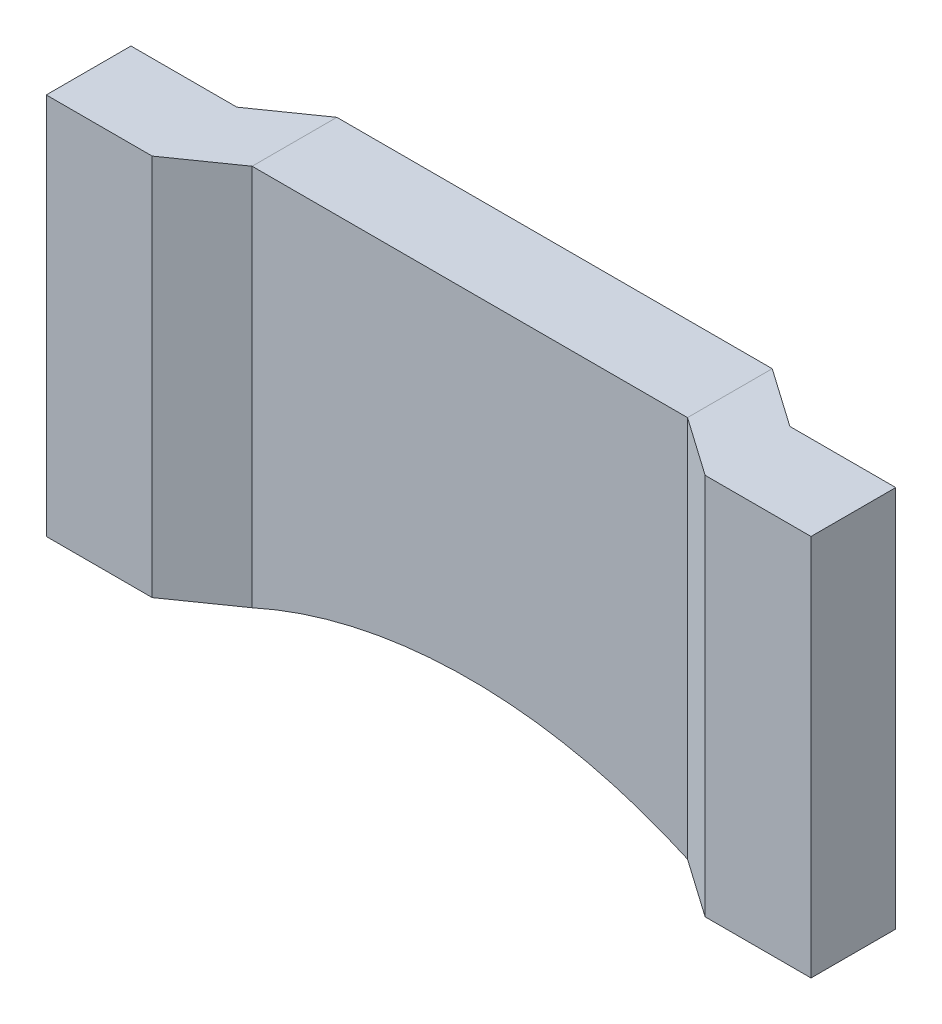
ISO-10303-21;
HEADER;
FILE_DESCRIPTION(('STEP AP214'),'2;1');
FILE_NAME('part.step','',(''),(''),'','','');
FILE_SCHEMA(('AUTOMOTIVE_DESIGN { 1 0 10303 214 1 1 1 1 }'));
ENDSEC;
DATA;
#1=APPLICATION_CONTEXT('core data for automotive mechanical design processes');
#2=APPLICATION_PROTOCOL_DEFINITION('international standard','automotive_design',2000,#1);
#3=PRODUCT_CONTEXT('',#1,'mechanical');
#4=PRODUCT('Part','Part','',(#3));
#5=PRODUCT_RELATED_PRODUCT_CATEGORY('part','',(#4));
#6=PRODUCT_DEFINITION_FORMATION('','',#4);
#7=PRODUCT_DEFINITION_CONTEXT('part definition',#1,'design');
#8=PRODUCT_DEFINITION('design','',#6,#7);
#9=PRODUCT_DEFINITION_SHAPE('','',#8);
#10=(LENGTH_UNIT() NAMED_UNIT(*) SI_UNIT(.MILLI.,.METRE.));
#11=(NAMED_UNIT(*) PLANE_ANGLE_UNIT() SI_UNIT($,.RADIAN.));
#12=(NAMED_UNIT(*) SI_UNIT($,.STERADIAN.) SOLID_ANGLE_UNIT());
#13=UNCERTAINTY_MEASURE_WITH_UNIT(LENGTH_MEASURE(1.E-05),#10,'distance_accuracy_value','');
#14=(GEOMETRIC_REPRESENTATION_CONTEXT(3) GLOBAL_UNCERTAINTY_ASSIGNED_CONTEXT((#13)) GLOBAL_UNIT_ASSIGNED_CONTEXT((#10,
#11,#12)) REPRESENTATION_CONTEXT('',''));
#15=CARTESIAN_POINT('',(0.,0.,0.));
#16=DIRECTION('',(0.,0.,1.));
#17=DIRECTION('',(1.,0.,0.));
#18=AXIS2_PLACEMENT_3D('',#15,#16,#17);
#19=CARTESIAN_POINT('',(13.1972792869676,-6.80902852139748,-0.54778034486598));
#20=DIRECTION('',(-8.74227765734793E-08,-1.,-4.37114091299597E-08));
#21=DIRECTION('',(-1.,8.74227765734794E-08,0.));
#22=AXIS2_PLACEMENT_3D('',#19,#20,#21);
#23=PLANE('',#22);
#24=DIRECTION('',(0.819152044289016,-9.66843804242312E-08,0.573576436351003));
#25=VECTOR('',#24,1.);
#26=CARTESIAN_POINT('',(12.9473533857876,-6.80902847616266,-1.08278034486598));
#27=LINE('',#26,#25);
#28=CARTESIAN_POINT('',(12.9473533857876,-6.80902847616266,-1.08278034486598));
#29=VERTEX_POINT('',#28);
#30=CARTESIAN_POINT('',(13.4472051881476,-6.80902853516008,-0.732780344865981));
#31=VERTEX_POINT('',#30);
#32=EDGE_CURVE('P0_E96',#29,#31,#27,.T.);
#33=ORIENTED_EDGE('',*,*,#32,.F.);
#34=DIRECTION('',(0.,4.37114091299602E-08,-1.));
#35=VECTOR('',#34,1.);
#36=CARTESIAN_POINT('',(12.9473533857876,-6.80902850763487,-0.362780344865978));
#37=LINE('',#36,#35);
#38=CARTESIAN_POINT('',(12.9473533857876,-6.80902850763487,-0.362780344865978));
#39=VERTEX_POINT('',#38);
#40=EDGE_CURVE('P0_E82',#39,#29,#37,.T.);
#41=ORIENTED_EDGE('',*,*,#40,.F.);
#42=DIRECTION('',(-0.819152044289016,9.66843804242312E-08,-0.573576436351003));
#43=VECTOR('',#42,1.);
#44=CARTESIAN_POINT('',(13.4472051881476,-6.80902856663231,-0.0127803448659834));
#45=LINE('',#44,#43);
#46=CARTESIAN_POINT('',(13.4472051881476,-6.80902856663231,-0.0127803448659834));
#47=VERTEX_POINT('',#46);
#48=EDGE_CURVE('P0_E27',#47,#39,#45,.T.);
#49=ORIENTED_EDGE('',*,*,#48,.F.);
#50=DIRECTION('',(-1.,8.74227765734794E-08,0.));
#51=VECTOR('',#50,1.);
#52=CARTESIAN_POINT('',(14.3472051881476,-6.8090286453128,-0.0127803448659904));
#53=LINE('',#52,#51);
#54=CARTESIAN_POINT('',(14.3472051881476,-6.8090286453128,-0.0127803448659904));
#55=VERTEX_POINT('',#54);
#56=EDGE_CURVE('P0_E136',#55,#47,#53,.T.);
#57=ORIENTED_EDGE('',*,*,#56,.F.);
#58=DIRECTION('',(0.,-4.37114091299602E-08,1.));
#59=VECTOR('',#58,1.);
#60=CARTESIAN_POINT('',(14.3472051881476,-6.80902861384058,-0.732780344865988));
#61=LINE('',#60,#59);
#62=CARTESIAN_POINT('',(14.3472051881476,-6.80902861384058,-0.732780344865988));
#63=VERTEX_POINT('',#62);
#64=EDGE_CURVE('P0_E142',#63,#55,#61,.T.);
#65=ORIENTED_EDGE('',*,*,#64,.F.);
#66=DIRECTION('',(1.,-8.74227765734794E-08,0.));
#67=VECTOR('',#66,1.);
#68=CARTESIAN_POINT('',(13.4472051881476,-6.80902853516008,-0.732780344865981));
#69=LINE('',#68,#67);
#70=EDGE_CURVE('P0_E110',#31,#63,#69,.T.);
#71=ORIENTED_EDGE('',*,*,#70,.F.);
#72=EDGE_LOOP('',(#33,#41,#49,#57,#65,#71));
#73=FACE_BOUND('',#72,.T.);
#74=ADVANCED_FACE('P0_F17',(#73),#23,.F.);
#75=CARTESIAN_POINT('',(13.1972790028436,-10.0590285213975,-0.547780486928059));
#76=DIRECTION('',(-8.74227765734793E-08,-1.,-4.37114091299597E-08));
#77=DIRECTION('',(-1.,8.74227765734794E-08,0.));
#78=AXIS2_PLACEMENT_3D('',#75,#76,#77);
#79=PLANE('',#78);
#80=DIRECTION('',(-0.819152044289016,9.66843804242312E-08,-0.573576436351003));
#81=VECTOR('',#80,1.);
#82=CARTESIAN_POINT('',(13.4472049040236,-10.0590285666323,-0.012780486928063));
#83=LINE('',#82,#81);
#84=CARTESIAN_POINT('',(13.4472049040236,-10.0590285666323,-0.012780486928063));
#85=VERTEX_POINT('',#84);
#86=CARTESIAN_POINT('',(12.9473531016636,-10.0590285076349,-0.362780486928059));
#87=VERTEX_POINT('',#86);
#88=EDGE_CURVE('P0_E11',#85,#87,#83,.T.);
#89=ORIENTED_EDGE('',*,*,#88,.T.);
#90=DIRECTION('',(0.,4.37114091299602E-08,-1.));
#91=VECTOR('',#90,1.);
#92=CARTESIAN_POINT('',(12.9473531016636,-10.0590285076349,-0.362780486928059));
#93=LINE('',#92,#91);
#94=CARTESIAN_POINT('',(12.9473531016636,-10.0590284761626,-1.08278048692806));
#95=VERTEX_POINT('',#94);
#96=EDGE_CURVE('P0_E75',#87,#95,#93,.T.);
#97=ORIENTED_EDGE('',*,*,#96,.T.);
#98=DIRECTION('',(0.819152044289016,-9.66843804242312E-08,0.573576436351003));
#99=VECTOR('',#98,1.);
#100=CARTESIAN_POINT('',(12.9473531016636,-10.0590284761626,-1.08278048692806));
#101=LINE('',#100,#99);
#102=CARTESIAN_POINT('',(13.4472049040236,-10.0590285351601,-0.732780486928061));
#103=VERTEX_POINT('',#102);
#104=EDGE_CURVE('P0_E63',#95,#103,#101,.T.);
#105=ORIENTED_EDGE('',*,*,#104,.T.);
#106=DIRECTION('',(1.,-8.74227765734794E-08,0.));
#107=VECTOR('',#106,1.);
#108=CARTESIAN_POINT('',(13.4472049040236,-10.0590285351601,-0.732780486928061));
#109=LINE('',#108,#107);
#110=CARTESIAN_POINT('',(14.3472049040236,-10.0590286138406,-0.732780486928068));
#111=VERTEX_POINT('',#110);
#112=EDGE_CURVE('P0_E107',#103,#111,#109,.T.);
#113=ORIENTED_EDGE('',*,*,#112,.T.);
#114=DIRECTION('',(0.,-4.37114091299602E-08,1.));
#115=VECTOR('',#114,1.);
#116=CARTESIAN_POINT('',(14.3472049040236,-10.0590286138406,-0.732780486928068));
#117=LINE('',#116,#115);
#118=CARTESIAN_POINT('',(14.3472049040236,-10.0590286453128,-0.0127804869280699));
#119=VERTEX_POINT('',#118);
#120=EDGE_CURVE('P0_E113',#111,#119,#117,.T.);
#121=ORIENTED_EDGE('',*,*,#120,.T.);
#122=DIRECTION('',(-1.,8.74227765734794E-08,0.));
#123=VECTOR('',#122,1.);
#124=CARTESIAN_POINT('',(14.3472049040236,-10.0590286453128,-0.0127804869280699));
#125=LINE('',#124,#123);
#126=EDGE_CURVE('P0_E100',#119,#85,#125,.T.);
#127=ORIENTED_EDGE('',*,*,#126,.T.);
#128=EDGE_LOOP('',(#89,#97,#105,#113,#121,#127));
#129=FACE_BOUND('',#128,.T.);
#130=ADVANCED_FACE('P0_F77',(#129),#79,.T.);
#131=CARTESIAN_POINT('',(13.4472051881476,-6.80902856663231,-0.0127803448659834));
#132=DIRECTION('',(-0.573576436351006,1.43373544953665E-08,0.819152044289018));
#133=DIRECTION('',(-0.819152044289016,9.66843804242312E-08,-0.573576436351003));
#134=AXIS2_PLACEMENT_3D('',#131,#132,#133);
#135=PLANE('',#134);
#136=ORIENTED_EDGE('',*,*,#48,.T.);
#137=DIRECTION('',(-8.74227765734793E-08,-1.,-4.37114091299597E-08));
#138=VECTOR('',#137,1.);
#139=CARTESIAN_POINT('',(12.9473533857876,-6.80902850763487,-0.362780344865978));
#140=LINE('',#139,#138);
#141=EDGE_CURVE('P0_E81',#39,#87,#140,.T.);
#142=ORIENTED_EDGE('',*,*,#141,.T.);
#143=ORIENTED_EDGE('',*,*,#88,.F.);
#144=DIRECTION('',(-8.74227765734793E-08,-1.,-4.37114091299597E-08));
#145=VECTOR('',#144,1.);
#146=CARTESIAN_POINT('',(13.4472051881476,-6.80902856663231,-0.0127803448659834));
#147=LINE('',#146,#145);
#148=EDGE_CURVE('P0_E123',#47,#85,#147,.T.);
#149=ORIENTED_EDGE('',*,*,#148,.F.);
#150=EDGE_LOOP('',(#136,#142,#143,#149));
#151=FACE_BOUND('',#150,.T.);
#152=ADVANCED_FACE('P0_F190',(#151),#135,.T.);
#153=CARTESIAN_POINT('',(12.9473533857876,-6.80902850763487,-0.362780344865978));
#154=DIRECTION('',(-1.,8.74227765734794E-08,0.));
#155=DIRECTION('',(0.,4.37114091299602E-08,-1.));
#156=AXIS2_PLACEMENT_3D('',#153,#154,#155);
#157=PLANE('',#156);
#158=ORIENTED_EDGE('',*,*,#40,.T.);
#159=DIRECTION('',(-8.74227765734793E-08,-1.,-4.37114091299597E-08));
#160=VECTOR('',#159,1.);
#161=CARTESIAN_POINT('',(12.9473533857876,-6.80902847616266,-1.08278034486598));
#162=LINE('',#161,#160);
#163=EDGE_CURVE('P0_E85',#29,#95,#162,.T.);
#164=ORIENTED_EDGE('',*,*,#163,.T.);
#165=ORIENTED_EDGE('',*,*,#96,.F.);
#166=ORIENTED_EDGE('',*,*,#141,.F.);
#167=EDGE_LOOP('',(#158,#164,#165,#166));
#168=FACE_BOUND('',#167,.T.);
#169=ADVANCED_FACE('P0_F86',(#168),#157,.T.);
#170=CARTESIAN_POINT('',(12.9473533857876,-6.80902847616266,-1.08278034486598));
#171=DIRECTION('',(0.573576436351006,-1.43373544953665E-08,-0.819152044289018));
#172=DIRECTION('',(0.819152044289016,-9.66843804242312E-08,0.573576436351003));
#173=AXIS2_PLACEMENT_3D('',#170,#171,#172);
#174=PLANE('',#173);
#175=ORIENTED_EDGE('',*,*,#32,.T.);
#176=DIRECTION('',(-8.74227765734793E-08,-1.,-4.37114091299597E-08));
#177=VECTOR('',#176,1.);
#178=CARTESIAN_POINT('',(13.4472051881476,-6.80902853516008,-0.732780344865981));
#179=LINE('',#178,#177);
#180=EDGE_CURVE('P0_E93',#31,#103,#179,.T.);
#181=ORIENTED_EDGE('',*,*,#180,.T.);
#182=ORIENTED_EDGE('',*,*,#104,.F.);
#183=ORIENTED_EDGE('',*,*,#163,.F.);
#184=EDGE_LOOP('',(#175,#181,#182,#183));
#185=FACE_BOUND('',#184,.T.);
#186=ADVANCED_FACE('P0_F91',(#185),#174,.T.);
#187=CARTESIAN_POINT('',(14.3472051881476,-6.8090286453128,-0.0127803448659904));
#188=DIRECTION('',(0.,-4.37114091299602E-08,1.));
#189=DIRECTION('',(-1.,8.74227765734794E-08,0.));
#190=AXIS2_PLACEMENT_3D('',#187,#188,#189);
#191=PLANE('',#190);
#192=ORIENTED_EDGE('',*,*,#56,.T.);
#193=ORIENTED_EDGE('',*,*,#148,.T.);
#194=ORIENTED_EDGE('',*,*,#126,.F.);
#195=DIRECTION('',(-8.74227765734793E-08,-1.,-4.37114091299597E-08));
#196=VECTOR('',#195,1.);
#197=CARTESIAN_POINT('',(14.3472051881476,-6.8090286453128,-0.0127803448659904));
#198=LINE('',#197,#196);
#199=EDGE_CURVE('P0_E118',#55,#119,#198,.T.);
#200=ORIENTED_EDGE('',*,*,#199,.F.);
#201=EDGE_LOOP('',(#192,#193,#194,#200));
#202=FACE_BOUND('',#201,.T.);
#203=ADVANCED_FACE('P0_F186',(#202),#191,.T.);
#204=CARTESIAN_POINT('',(13.4472051881476,-6.80902853516008,-0.732780344865981));
#205=DIRECTION('',(0.,4.37114091299602E-08,-1.));
#206=DIRECTION('',(1.,-8.74227765734794E-08,0.));
#207=AXIS2_PLACEMENT_3D('',#204,#205,#206);
#208=PLANE('',#207);
#209=ORIENTED_EDGE('',*,*,#70,.T.);
#210=DIRECTION('',(-8.74227765734793E-08,-1.,-4.37114091299597E-08));
#211=VECTOR('',#210,1.);
#212=CARTESIAN_POINT('',(14.3472051881476,-6.80902861384058,-0.732780344865988));
#213=LINE('',#212,#211);
#214=EDGE_CURVE('P0_E117',#63,#111,#213,.T.);
#215=ORIENTED_EDGE('',*,*,#214,.T.);
#216=ORIENTED_EDGE('',*,*,#112,.F.);
#217=ORIENTED_EDGE('',*,*,#180,.F.);
#218=EDGE_LOOP('',(#209,#215,#216,#217));
#219=FACE_BOUND('',#218,.T.);
#220=ADVANCED_FACE('P0_F215',(#219),#208,.T.);
#221=CARTESIAN_POINT('',(14.3472051881476,-6.80902861384058,-0.732780344865988));
#222=DIRECTION('',(1.,-8.74227765734794E-08,0.));
#223=DIRECTION('',(0.,-4.37114091299602E-08,1.));
#224=AXIS2_PLACEMENT_3D('',#221,#222,#223);
#225=PLANE('',#224);
#226=ORIENTED_EDGE('',*,*,#64,.T.);
#227=ORIENTED_EDGE('',*,*,#199,.T.);
#228=ORIENTED_EDGE('',*,*,#120,.F.);
#229=ORIENTED_EDGE('',*,*,#214,.F.);
#230=EDGE_LOOP('',(#226,#227,#228,#229));
#231=FACE_BOUND('',#230,.T.);
#232=ADVANCED_FACE('P0_F194',(#231),#225,.T.);
#233=CLOSED_SHELL('',(#74,#130,#152,#169,#186,#203,#220,#232));
#234=MANIFOLD_SOLID_BREP('P0_B1',#233);
#235=CARTESIAN_POINT('',(8.99713108932762,-6.80902815420886,-0.547780344865948));
#236=DIRECTION('',(-8.74227765734793E-08,-1.,-4.37114091299597E-08));
#237=DIRECTION('',(-1.,8.74227765734794E-08,0.));
#238=AXIS2_PLACEMENT_3D('',#235,#236,#237);
#239=PLANE('',#238);
#240=DIRECTION('',(0.819152044289011,-4.6540711870944E-08,-0.573576436351015));
#241=VECTOR('',#240,1.);
#242=CARTESIAN_POINT('',(8.74720518814762,-6.80902812427303,-0.732780344865945));
#243=LINE('',#242,#241);
#244=CARTESIAN_POINT('',(8.74720518814762,-6.80902812427303,-0.732780344865945));
#245=VERTEX_POINT('',#244);
#246=CARTESIAN_POINT('',(9.24705699050762,-6.80902815267248,-1.08278034486595));
#247=VERTEX_POINT('',#246);
#248=EDGE_CURVE('P1_E27',#245,#247,#243,.T.);
#249=ORIENTED_EDGE('',*,*,#248,.F.);
#250=DIRECTION('',(1.,-8.74227765734794E-08,0.));
#251=VECTOR('',#250,1.);
#252=CARTESIAN_POINT('',(7.84720518814763,-6.80902804559254,-0.732780344865939));
#253=LINE('',#252,#251);
#254=CARTESIAN_POINT('',(7.84720518814763,-6.80902804559254,-0.732780344865939));
#255=VERTEX_POINT('',#254);
#256=EDGE_CURVE('P1_E147',#255,#245,#253,.T.);
#257=ORIENTED_EDGE('',*,*,#256,.F.);
#258=DIRECTION('',(0.,4.37114091299602E-08,-1.));
#259=VECTOR('',#258,1.);
#260=CARTESIAN_POINT('',(7.84720518814763,-6.80902807706475,-0.0127803448659405));
#261=LINE('',#260,#259);
#262=CARTESIAN_POINT('',(7.84720518814763,-6.80902807706475,-0.0127803448659405));
#263=VERTEX_POINT('',#262);
#264=EDGE_CURVE('P1_E65',#263,#255,#261,.T.);
#265=ORIENTED_EDGE('',*,*,#264,.F.);
#266=DIRECTION('',(-1.,8.74227765734794E-08,0.));
#267=VECTOR('',#266,1.);
#268=CARTESIAN_POINT('',(8.74720518814762,-6.80902815574525,-0.0127803448659474));
#269=LINE('',#268,#267);
#270=CARTESIAN_POINT('',(8.74720518814762,-6.80902815574525,-0.0127803448659474));
#271=VERTEX_POINT('',#270);
#272=EDGE_CURVE('P1_E157',#271,#263,#269,.T.);
#273=ORIENTED_EDGE('',*,*,#272,.F.);
#274=DIRECTION('',(-0.819152044289011,4.6540711870944E-08,0.573576436351015));
#275=VECTOR('',#274,1.);
#276=CARTESIAN_POINT('',(9.24705699050762,-6.80902818414469,-0.36278034486595));
#277=LINE('',#276,#275);
#278=CARTESIAN_POINT('',(9.24705699050762,-6.80902818414469,-0.36278034486595));
#279=VERTEX_POINT('',#278);
#280=EDGE_CURVE('P1_E115',#279,#271,#277,.T.);
#281=ORIENTED_EDGE('',*,*,#280,.F.);
#282=DIRECTION('',(0.,-4.37114091299602E-08,1.));
#283=VECTOR('',#282,1.);
#284=CARTESIAN_POINT('',(9.24705699050762,-6.80902815267248,-1.08278034486595));
#285=LINE('',#284,#283);
#286=EDGE_CURVE('P1_E101',#247,#279,#285,.T.);
#287=ORIENTED_EDGE('',*,*,#286,.F.);
#288=EDGE_LOOP('',(#249,#257,#265,#273,#281,#287));
#289=FACE_BOUND('',#288,.T.);
#290=ADVANCED_FACE('P1_F17',(#289),#239,.F.);
#291=CARTESIAN_POINT('',(8.99713080520359,-10.0590281542088,-0.547780486928027));
#292=DIRECTION('',(-8.74227765734793E-08,-1.,-4.37114091299597E-08));
#293=DIRECTION('',(-1.,8.74227765734794E-08,0.));
#294=AXIS2_PLACEMENT_3D('',#291,#292,#293);
#295=PLANE('',#294);
#296=DIRECTION('',(0.819152044289011,-4.6540711870944E-08,-0.573576436351015));
#297=VECTOR('',#296,1.);
#298=CARTESIAN_POINT('',(8.74720490402361,-10.059028124273,-0.732780486928025));
#299=LINE('',#298,#297);
#300=CARTESIAN_POINT('',(8.74720490402361,-10.059028124273,-0.732780486928025));
#301=VERTEX_POINT('',#300);
#302=CARTESIAN_POINT('',(9.24705670638359,-10.0590281526725,-1.08278048692803));
#303=VERTEX_POINT('',#302);
#304=EDGE_CURVE('P1_E11',#301,#303,#299,.T.);
#305=ORIENTED_EDGE('',*,*,#304,.T.);
#306=DIRECTION('',(0.,-4.37114091299602E-08,1.));
#307=VECTOR('',#306,1.);
#308=CARTESIAN_POINT('',(9.24705670638359,-10.0590281526725,-1.08278048692803));
#309=LINE('',#308,#307);
#310=CARTESIAN_POINT('',(9.24705670638359,-10.0590281841447,-0.36278048692803));
#311=VERTEX_POINT('',#310);
#312=EDGE_CURVE('P1_E90',#303,#311,#309,.T.);
#313=ORIENTED_EDGE('',*,*,#312,.T.);
#314=DIRECTION('',(-0.819152044289011,4.6540711870944E-08,0.573576436351015));
#315=VECTOR('',#314,1.);
#316=CARTESIAN_POINT('',(9.24705670638359,-10.0590281841447,-0.36278048692803));
#317=LINE('',#316,#315);
#318=CARTESIAN_POINT('',(8.74720490402361,-10.0590281557452,-0.0127804869280274));
#319=VERTEX_POINT('',#318);
#320=EDGE_CURVE('P1_E95',#311,#319,#317,.T.);
#321=ORIENTED_EDGE('',*,*,#320,.T.);
#322=DIRECTION('',(-1.,8.74227765734794E-08,0.));
#323=VECTOR('',#322,1.);
#324=CARTESIAN_POINT('',(8.74720490402361,-10.0590281557452,-0.0127804869280274));
#325=LINE('',#324,#323);
#326=CARTESIAN_POINT('',(7.8472049040236,-10.0590280770647,-0.0127804869280205));
#327=VERTEX_POINT('',#326);
#328=EDGE_CURVE('P1_E126',#319,#327,#325,.T.);
#329=ORIENTED_EDGE('',*,*,#328,.T.);
#330=DIRECTION('',(0.,4.37114091299602E-08,-1.));
#331=VECTOR('',#330,1.);
#332=CARTESIAN_POINT('',(7.8472049040236,-10.0590280770647,-0.0127804869280205));
#333=LINE('',#332,#331);
#334=CARTESIAN_POINT('',(7.8472049040236,-10.0590280455925,-0.732780486928018));
#335=VERTEX_POINT('',#334);
#336=EDGE_CURVE('P1_E119',#327,#335,#333,.T.);
#337=ORIENTED_EDGE('',*,*,#336,.T.);
#338=DIRECTION('',(1.,-8.74227765734794E-08,0.));
#339=VECTOR('',#338,1.);
#340=CARTESIAN_POINT('',(7.8472049040236,-10.0590280455925,-0.732780486928018));
#341=LINE('',#340,#339);
#342=EDGE_CURVE('P1_E136',#335,#301,#341,.T.);
#343=ORIENTED_EDGE('',*,*,#342,.T.);
#344=EDGE_LOOP('',(#305,#313,#321,#329,#337,#343));
#345=FACE_BOUND('',#344,.T.);
#346=ADVANCED_FACE('P1_F92',(#345),#295,.T.);
#347=CARTESIAN_POINT('',(8.74720518814762,-6.80902812427303,-0.732780344865945));
#348=DIRECTION('',(-0.573576436351012,8.59499347904874E-08,-0.819152044289009));
#349=DIRECTION('',(0.819152044289011,-4.6540711870944E-08,-0.573576436351015));
#350=AXIS2_PLACEMENT_3D('',#347,#348,#349);
#351=PLANE('',#350);
#352=ORIENTED_EDGE('',*,*,#248,.T.);
#353=DIRECTION('',(-8.74227765734793E-08,-1.,-4.37114091299597E-08));
#354=VECTOR('',#353,1.);
#355=CARTESIAN_POINT('',(9.24705699050762,-6.80902815267248,-1.08278034486595));
#356=LINE('',#355,#354);
#357=EDGE_CURVE('P1_E100',#247,#303,#356,.T.);
#358=ORIENTED_EDGE('',*,*,#357,.T.);
#359=ORIENTED_EDGE('',*,*,#304,.F.);
#360=DIRECTION('',(-8.74227765734793E-08,-1.,-4.37114091299597E-08));
#361=VECTOR('',#360,1.);
#362=CARTESIAN_POINT('',(8.74720518814762,-6.80902812427303,-0.732780344865945));
#363=LINE('',#362,#361);
#364=EDGE_CURVE('P1_E140',#245,#301,#363,.T.);
#365=ORIENTED_EDGE('',*,*,#364,.F.);
#366=EDGE_LOOP('',(#352,#358,#359,#365));
#367=FACE_BOUND('',#366,.T.);
#368=ADVANCED_FACE('P1_F195',(#367),#351,.T.);
#369=CARTESIAN_POINT('',(9.24705699050762,-6.80902815267248,-1.08278034486595));
#370=DIRECTION('',(1.,-8.74227765734794E-08,0.));
#371=DIRECTION('',(0.,-4.37114091299602E-08,1.));
#372=AXIS2_PLACEMENT_3D('',#369,#370,#371);
#373=PLANE('',#372);
#374=ORIENTED_EDGE('',*,*,#286,.T.);
#375=DIRECTION('',(-8.74227765734793E-08,-1.,-4.37114091299597E-08));
#376=VECTOR('',#375,1.);
#377=CARTESIAN_POINT('',(9.24705699050762,-6.80902818414469,-0.36278034486595));
#378=LINE('',#377,#376);
#379=EDGE_CURVE('P1_E104',#279,#311,#378,.T.);
#380=ORIENTED_EDGE('',*,*,#379,.T.);
#381=ORIENTED_EDGE('',*,*,#312,.F.);
#382=ORIENTED_EDGE('',*,*,#357,.F.);
#383=EDGE_LOOP('',(#374,#380,#381,#382));
#384=FACE_BOUND('',#383,.T.);
#385=ADVANCED_FACE('P1_F105',(#384),#373,.T.);
#386=CARTESIAN_POINT('',(9.24705699050762,-6.80902818414469,-0.36278034486595));
#387=DIRECTION('',(0.573576436351012,-8.59499347904874E-08,0.819152044289009));
#388=DIRECTION('',(-0.819152044289011,4.6540711870944E-08,0.573576436351015));
#389=AXIS2_PLACEMENT_3D('',#386,#387,#388);
#390=PLANE('',#389);
#391=ORIENTED_EDGE('',*,*,#280,.T.);
#392=DIRECTION('',(-8.74227765734793E-08,-1.,-4.37114091299597E-08));
#393=VECTOR('',#392,1.);
#394=CARTESIAN_POINT('',(8.74720518814762,-6.80902815574525,-0.0127803448659474));
#395=LINE('',#394,#393);
#396=EDGE_CURVE('P1_E112',#271,#319,#395,.T.);
#397=ORIENTED_EDGE('',*,*,#396,.T.);
#398=ORIENTED_EDGE('',*,*,#320,.F.);
#399=ORIENTED_EDGE('',*,*,#379,.F.);
#400=EDGE_LOOP('',(#391,#397,#398,#399));
#401=FACE_BOUND('',#400,.T.);
#402=ADVANCED_FACE('P1_F110',(#401),#390,.T.);
#403=CARTESIAN_POINT('',(7.84720518814763,-6.80902807706475,-0.0127803448659405));
#404=DIRECTION('',(-1.,8.74227765734794E-08,0.));
#405=DIRECTION('',(0.,4.37114091299602E-08,-1.));
#406=AXIS2_PLACEMENT_3D('',#403,#404,#405);
#407=PLANE('',#406);
#408=ORIENTED_EDGE('',*,*,#264,.T.);
#409=DIRECTION('',(-8.74227765734793E-08,-1.,-4.37114091299597E-08));
#410=VECTOR('',#409,1.);
#411=CARTESIAN_POINT('',(7.84720518814763,-6.80902804559254,-0.732780344865939));
#412=LINE('',#411,#410);
#413=EDGE_CURVE('P1_E139',#255,#335,#412,.T.);
#414=ORIENTED_EDGE('',*,*,#413,.T.);
#415=ORIENTED_EDGE('',*,*,#336,.F.);
#416=DIRECTION('',(-8.74227765734793E-08,-1.,-4.37114091299597E-08));
#417=VECTOR('',#416,1.);
#418=CARTESIAN_POINT('',(7.84720518814763,-6.80902807706475,-0.0127803448659405));
#419=LINE('',#418,#417);
#420=EDGE_CURVE('P1_E129',#263,#327,#419,.T.);
#421=ORIENTED_EDGE('',*,*,#420,.F.);
#422=EDGE_LOOP('',(#408,#414,#415,#421));
#423=FACE_BOUND('',#422,.T.);
#424=ADVANCED_FACE('P1_F197',(#423),#407,.T.);
#425=CARTESIAN_POINT('',(7.84720518814763,-6.80902804559254,-0.732780344865939));
#426=DIRECTION('',(0.,4.37114091299602E-08,-1.));
#427=DIRECTION('',(1.,-8.74227765734794E-08,0.));
#428=AXIS2_PLACEMENT_3D('',#425,#426,#427);
#429=PLANE('',#428);
#430=ORIENTED_EDGE('',*,*,#256,.T.);
#431=ORIENTED_EDGE('',*,*,#364,.T.);
#432=ORIENTED_EDGE('',*,*,#342,.F.);
#433=ORIENTED_EDGE('',*,*,#413,.F.);
#434=EDGE_LOOP('',(#430,#431,#432,#433));
#435=FACE_BOUND('',#434,.T.);
#436=ADVANCED_FACE('P1_F194',(#435),#429,.T.);
#437=CARTESIAN_POINT('',(8.74720518814762,-6.80902815574525,-0.0127803448659474));
#438=DIRECTION('',(0.,-4.37114091299602E-08,1.));
#439=DIRECTION('',(-1.,8.74227765734794E-08,0.));
#440=AXIS2_PLACEMENT_3D('',#437,#438,#439);
#441=PLANE('',#440);
#442=ORIENTED_EDGE('',*,*,#272,.T.);
#443=ORIENTED_EDGE('',*,*,#420,.T.);
#444=ORIENTED_EDGE('',*,*,#328,.F.);
#445=ORIENTED_EDGE('',*,*,#396,.F.);
#446=EDGE_LOOP('',(#442,#443,#444,#445));
#447=FACE_BOUND('',#446,.T.);
#448=ADVANCED_FACE('P1_F268',(#447),#441,.T.);
#449=CLOSED_SHELL('',(#290,#346,#368,#385,#402,#424,#436,#448));
#450=MANIFOLD_SOLID_BREP('P1_B1',#449);
#451=CARTESIAN_POINT('',(11.0972051881476,-6.80902833015368,-0.722780344865964));
#452=DIRECTION('',(8.74227765734793E-08,1.,4.37114091299597E-08));
#453=DIRECTION('',(1.,-8.74227765734794E-08,0.));
#454=AXIS2_PLACEMENT_3D('',#451,#452,#453);
#455=PLANE('',#454);
#456=DIRECTION('',(-1.,8.74227765734794E-08,0.));
#457=VECTOR('',#456,1.);
#458=CARTESIAN_POINT('',(12.9473533857876,-6.80902847616266,-1.08278034486598));
#459=LINE('',#458,#457);
#460=CARTESIAN_POINT('',(12.9473533857876,-6.80902847616266,-1.08278034486598));
#461=VERTEX_POINT('',#460);
#462=CARTESIAN_POINT('',(9.24705699050762,-6.80902815267248,-1.08278034486595));
#463=VERTEX_POINT('',#462);
#464=EDGE_CURVE('P2_E11',#461,#463,#459,.T.);
#465=ORIENTED_EDGE('',*,*,#464,.T.);
#466=DIRECTION('',(0.,-4.37114091299602E-08,1.));
#467=VECTOR('',#466,1.);
#468=CARTESIAN_POINT('',(9.24705699050762,-6.80902815267248,-1.08278034486595));
#469=LINE('',#468,#467);
#470=CARTESIAN_POINT('',(9.24705699050762,-6.80902818414469,-0.36278034486595));
#471=VERTEX_POINT('',#470);
#472=EDGE_CURVE('P2_E118',#463,#471,#469,.T.);
#473=ORIENTED_EDGE('',*,*,#472,.T.);
#474=DIRECTION('',(1.,-8.74227765734794E-08,0.));
#475=VECTOR('',#474,1.);
#476=CARTESIAN_POINT('',(9.24705699050762,-6.80902818414469,-0.36278034486595));
#477=LINE('',#476,#475);
#478=CARTESIAN_POINT('',(12.9473533857876,-6.80902850763487,-0.362780344865978));
#479=VERTEX_POINT('',#478);
#480=EDGE_CURVE('P2_E73',#471,#479,#477,.T.);
#481=ORIENTED_EDGE('',*,*,#480,.T.);
#482=DIRECTION('',(0.,4.37114091299602E-08,-1.));
#483=VECTOR('',#482,1.);
#484=CARTESIAN_POINT('',(12.9473533857876,-6.80902850763487,-0.362780344865978));
#485=LINE('',#484,#483);
#486=EDGE_CURVE('P2_E124',#479,#461,#485,.T.);
#487=ORIENTED_EDGE('',*,*,#486,.T.);
#488=EDGE_LOOP('',(#465,#473,#481,#487));
#489=FACE_BOUND('',#488,.T.);
#490=ADVANCED_FACE('P2_F17',(#489),#455,.T.);
#491=CARTESIAN_POINT('',(12.9473531016636,-10.0590284761626,-1.08278048692806));
#492=DIRECTION('',(0.,4.37114091299602E-08,-1.));
#493=DIRECTION('',(-1.,8.74227765734794E-08,0.));
#494=AXIS2_PLACEMENT_3D('',#491,#492,#493);
#495=PLANE('',#494);
#496=CARTESIAN_POINT('',(11.0972045474426,-14.1378387559565,-1.08278066521859));
#497=DIRECTION('',(0.,-4.37114091299602E-08,1.));
#498=DIRECTION('',(-0.413089114890717,0.910690607812997,3.98075713274905E-08));
#499=AXIS2_PLACEMENT_3D('',#496,#497,#498);
#500=CIRCLE('',#499,4.478810441539);
#501=CARTESIAN_POINT('',(12.9473531016636,-10.0590284761626,-1.08278048692806));
#502=VERTEX_POINT('',#501);
#503=CARTESIAN_POINT('',(9.24705670638359,-10.0590281526725,-1.08278048692803));
#504=VERTEX_POINT('',#503);
#505=EDGE_CURVE('P2_E86',#502,#504,#500,.T.);
#506=ORIENTED_EDGE('',*,*,#505,.T.);
#507=DIRECTION('',(8.74227765734793E-08,1.,4.37114091299597E-08));
#508=VECTOR('',#507,1.);
#509=CARTESIAN_POINT('',(9.24705670638359,-10.0590281526725,-1.08278048692803));
#510=LINE('',#509,#508);
#511=EDGE_CURVE('P2_E27',#504,#463,#510,.T.);
#512=ORIENTED_EDGE('',*,*,#511,.T.);
#513=ORIENTED_EDGE('',*,*,#464,.F.);
#514=DIRECTION('',(8.74227765734793E-08,1.,4.37114091299597E-08));
#515=VECTOR('',#514,1.);
#516=CARTESIAN_POINT('',(12.9473531016636,-10.0590284761626,-1.08278048692806));
#517=LINE('',#516,#515);
#518=EDGE_CURVE('P2_E77',#502,#461,#517,.T.);
#519=ORIENTED_EDGE('',*,*,#518,.F.);
#520=EDGE_LOOP('',(#506,#512,#513,#519));
#521=FACE_BOUND('',#520,.T.);
#522=ADVANCED_FACE('P2_F141',(#521),#495,.T.);
#523=CARTESIAN_POINT('',(9.24705670638359,-10.0590281526725,-1.08278048692803));
#524=DIRECTION('',(-1.,8.74227765734794E-08,0.));
#525=DIRECTION('',(0.,-4.37114091299602E-08,1.));
#526=AXIS2_PLACEMENT_3D('',#523,#524,#525);
#527=PLANE('',#526);
#528=DIRECTION('',(0.,-4.37114091299602E-08,1.));
#529=VECTOR('',#528,1.);
#530=CARTESIAN_POINT('',(9.24705670638359,-10.0590281526725,-1.08278048692803));
#531=LINE('',#530,#529);
#532=CARTESIAN_POINT('',(9.24705670638359,-10.0590281841447,-0.36278048692803));
#533=VERTEX_POINT('',#532);
#534=EDGE_CURVE('P2_E80',#504,#533,#531,.T.);
#535=ORIENTED_EDGE('',*,*,#534,.T.);
#536=DIRECTION('',(8.74227765734793E-08,1.,4.37114091299597E-08));
#537=VECTOR('',#536,1.);
#538=CARTESIAN_POINT('',(9.24705670638359,-10.0590281841447,-0.36278048692803));
#539=LINE('',#538,#537);
#540=EDGE_CURVE('P2_E66',#533,#471,#539,.T.);
#541=ORIENTED_EDGE('',*,*,#540,.T.);
#542=ORIENTED_EDGE('',*,*,#472,.F.);
#543=ORIENTED_EDGE('',*,*,#511,.F.);
#544=EDGE_LOOP('',(#535,#541,#542,#543));
#545=FACE_BOUND('',#544,.T.);
#546=ADVANCED_FACE('P2_F81',(#545),#527,.T.);
#547=CARTESIAN_POINT('',(12.9473531016636,-10.0590285076349,-0.362780486928059));
#548=DIRECTION('',(1.,-8.74227765734794E-08,0.));
#549=DIRECTION('',(0.,4.37114091299602E-08,-1.));
#550=AXIS2_PLACEMENT_3D('',#547,#548,#549);
#551=PLANE('',#550);
#552=DIRECTION('',(0.,4.37114091299602E-08,-1.));
#553=VECTOR('',#552,1.);
#554=CARTESIAN_POINT('',(12.9473531016636,-10.0590285076349,-0.362780486928059));
#555=LINE('',#554,#553);
#556=CARTESIAN_POINT('',(12.9473531016636,-10.0590285076349,-0.362780486928059));
#557=VERTEX_POINT('',#556);
#558=EDGE_CURVE('P2_E91',#557,#502,#555,.T.);
#559=ORIENTED_EDGE('',*,*,#558,.T.);
#560=ORIENTED_EDGE('',*,*,#518,.T.);
#561=ORIENTED_EDGE('',*,*,#486,.F.);
#562=DIRECTION('',(8.74227765734793E-08,1.,4.37114091299597E-08));
#563=VECTOR('',#562,1.);
#564=CARTESIAN_POINT('',(12.9473531016636,-10.0590285076349,-0.362780486928059));
#565=LINE('',#564,#563);
#566=EDGE_CURVE('P2_E101',#557,#479,#565,.T.);
#567=ORIENTED_EDGE('',*,*,#566,.F.);
#568=EDGE_LOOP('',(#559,#560,#561,#567));
#569=FACE_BOUND('',#568,.T.);
#570=ADVANCED_FACE('P2_F139',(#569),#551,.T.);
#571=CARTESIAN_POINT('',(9.24705670638359,-10.0590281841447,-0.36278048692803));
#572=DIRECTION('',(0.,-4.37114091299602E-08,1.));
#573=DIRECTION('',(1.,-8.74227765734794E-08,0.));
#574=AXIS2_PLACEMENT_3D('',#571,#572,#573);
#575=PLANE('',#574);
#576=CARTESIAN_POINT('',(11.0972045474427,-14.1378387874288,-0.362780665218596));
#577=DIRECTION('',(0.,4.37114091299602E-08,-1.));
#578=DIRECTION('',(-0.413089114890717,0.910690607812997,3.98075713274905E-08));
#579=AXIS2_PLACEMENT_3D('',#576,#577,#578);
#580=CIRCLE('',#579,4.478810441539);
#581=EDGE_CURVE('P2_E71',#533,#557,#580,.T.);
#582=ORIENTED_EDGE('',*,*,#581,.T.);
#583=ORIENTED_EDGE('',*,*,#566,.T.);
#584=ORIENTED_EDGE('',*,*,#480,.F.);
#585=ORIENTED_EDGE('',*,*,#540,.F.);
#586=EDGE_LOOP('',(#582,#583,#584,#585));
#587=FACE_BOUND('',#586,.T.);
#588=ADVANCED_FACE('P2_F68',(#587),#575,.T.);
#589=CARTESIAN_POINT('',(11.0972045474426,-14.1378387559565,-1.08278066521859));
#590=DIRECTION('',(0.,-4.37114091299602E-08,1.));
#591=DIRECTION('',(-0.413089114890717,0.910690607812997,3.98075713274905E-08));
#592=AXIS2_PLACEMENT_3D('',#589,#590,#591);
#593=CYLINDRICAL_SURFACE('',#592,4.478810441539);
#594=ORIENTED_EDGE('',*,*,#581,.F.);
#595=ORIENTED_EDGE('',*,*,#534,.F.);
#596=ORIENTED_EDGE('',*,*,#505,.F.);
#597=ORIENTED_EDGE('',*,*,#558,.F.);
#598=EDGE_LOOP('',(#594,#595,#596,#597));
#599=FACE_BOUND('',#598,.T.);
#600=ADVANCED_FACE('P2_F89',(#599),#593,.F.);
#601=CLOSED_SHELL('',(#490,#522,#546,#570,#588,#600));
#602=MANIFOLD_SOLID_BREP('P2_B1',#601);
#603=ADVANCED_BREP_SHAPE_REPRESENTATION('',(#18,#234,#450,#602),#14);
#604=SHAPE_DEFINITION_REPRESENTATION(#9,#603);
ENDSEC;
END-ISO-10303-21;
